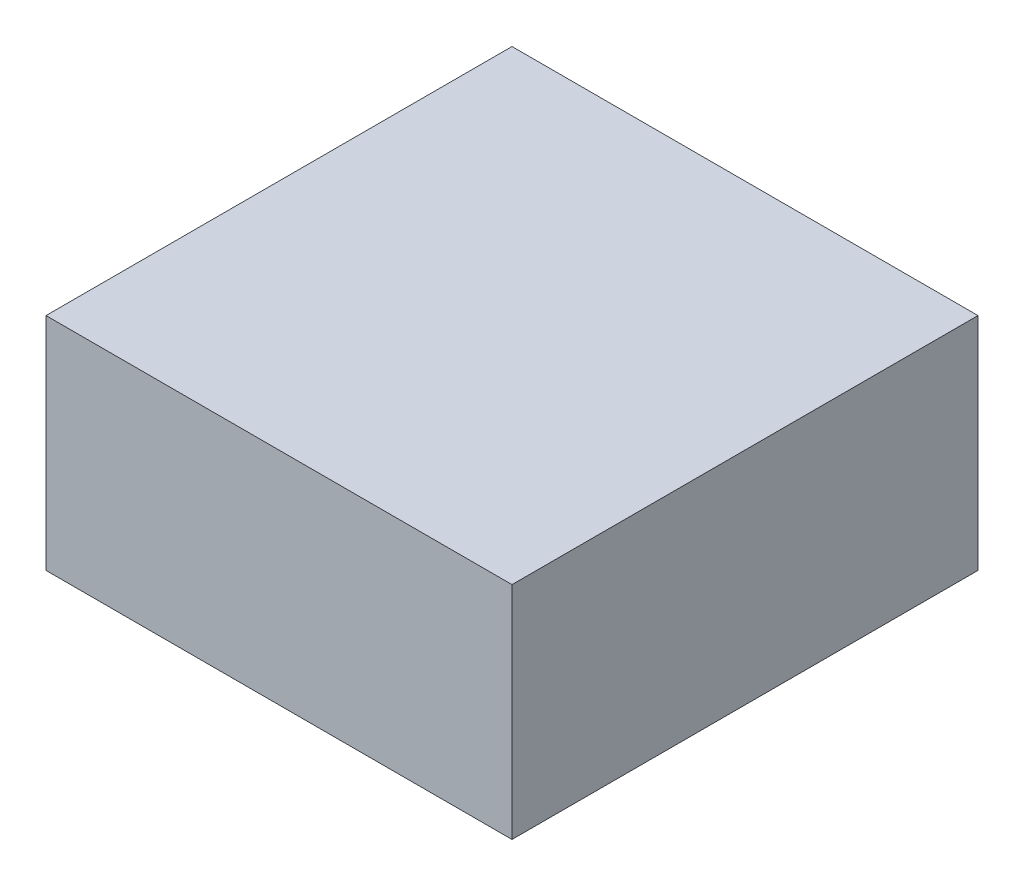
ISO-10303-21;
HEADER;
FILE_DESCRIPTION(('STEP AP214'),'2;1');
FILE_NAME('part.step','',(''),(''),'','','');
FILE_SCHEMA(('AUTOMOTIVE_DESIGN { 1 0 10303 214 1 1 1 1 }'));
ENDSEC;
DATA;
#1=APPLICATION_CONTEXT('core data for automotive mechanical design processes');
#2=APPLICATION_PROTOCOL_DEFINITION('international standard','automotive_design',2000,#1);
#3=PRODUCT_CONTEXT('',#1,'mechanical');
#4=PRODUCT('Part','Part','',(#3));
#5=PRODUCT_RELATED_PRODUCT_CATEGORY('part','',(#4));
#6=PRODUCT_DEFINITION_FORMATION('','',#4);
#7=PRODUCT_DEFINITION_CONTEXT('part definition',#1,'design');
#8=PRODUCT_DEFINITION('design','',#6,#7);
#9=PRODUCT_DEFINITION_SHAPE('','',#8);
#10=(LENGTH_UNIT() NAMED_UNIT(*) SI_UNIT(.MILLI.,.METRE.));
#11=(NAMED_UNIT(*) PLANE_ANGLE_UNIT() SI_UNIT($,.RADIAN.));
#12=(NAMED_UNIT(*) SI_UNIT($,.STERADIAN.) SOLID_ANGLE_UNIT());
#13=UNCERTAINTY_MEASURE_WITH_UNIT(LENGTH_MEASURE(1.E-05),#10,'distance_accuracy_value','');
#14=(GEOMETRIC_REPRESENTATION_CONTEXT(3) GLOBAL_UNCERTAINTY_ASSIGNED_CONTEXT((#13)) GLOBAL_UNIT_ASSIGNED_CONTEXT((#10,
#11,#12)) REPRESENTATION_CONTEXT('',''));
#15=CARTESIAN_POINT('',(0.,0.,0.));
#16=DIRECTION('',(0.,0.,1.));
#17=DIRECTION('',(1.,0.,0.));
#18=AXIS2_PLACEMENT_3D('',#15,#16,#17);
#19=CARTESIAN_POINT('',(0.,18.,0.));
#20=DIRECTION('',(1.,0.,0.));
#21=DIRECTION('',(0.,0.,-1.));
#22=AXIS2_PLACEMENT_3D('',#19,#20,#21);
#23=PLANE('',#22);
#24=DIRECTION('',(0.,0.,1.));
#25=VECTOR('',#24,1.);
#26=CARTESIAN_POINT('',(0.,0.,0.));
#27=LINE('',#26,#25);
#28=CARTESIAN_POINT('',(0.,0.,-38.));
#29=VERTEX_POINT('',#28);
#30=CARTESIAN_POINT('',(0.,0.,0.));
#31=VERTEX_POINT('',#30);
#32=EDGE_CURVE('E96',#29,#31,#27,.T.);
#33=ORIENTED_EDGE('',*,*,#32,.T.);
#34=DIRECTION('',(0.,-1.,0.));
#35=VECTOR('',#34,1.);
#36=CARTESIAN_POINT('',(0.,18.,0.));
#37=LINE('',#36,#35);
#38=CARTESIAN_POINT('',(0.,18.,0.));
#39=VERTEX_POINT('',#38);
#40=EDGE_CURVE('E11',#39,#31,#37,.T.);
#41=ORIENTED_EDGE('',*,*,#40,.F.);
#42=DIRECTION('',(0.,0.,1.));
#43=VECTOR('',#42,1.);
#44=CARTESIAN_POINT('',(0.,18.,0.));
#45=LINE('',#44,#43);
#46=CARTESIAN_POINT('',(0.,18.,-38.));
#47=VERTEX_POINT('',#46);
#48=EDGE_CURVE('E84',#47,#39,#45,.T.);
#49=ORIENTED_EDGE('',*,*,#48,.F.);
#50=DIRECTION('',(0.,-1.,0.));
#51=VECTOR('',#50,1.);
#52=CARTESIAN_POINT('',(0.,18.,-38.));
#53=LINE('',#52,#51);
#54=EDGE_CURVE('E92',#47,#29,#53,.T.);
#55=ORIENTED_EDGE('',*,*,#54,.T.);
#56=EDGE_LOOP('',(#33,#41,#49,#55));
#57=FACE_BOUND('',#56,.T.);
#58=ADVANCED_FACE('F33',(#57),#23,.F.);
#59=CARTESIAN_POINT('',(0.,18.,0.));
#60=DIRECTION('',(0.,0.,-1.));
#61=DIRECTION('',(-1.,0.,0.));
#62=AXIS2_PLACEMENT_3D('',#59,#60,#61);
#63=PLANE('',#62);
#64=DIRECTION('',(1.,0.,0.));
#65=VECTOR('',#64,1.);
#66=CARTESIAN_POINT('',(0.,0.,0.));
#67=LINE('',#66,#65);
#68=CARTESIAN_POINT('',(38.,0.,0.));
#69=VERTEX_POINT('',#68);
#70=EDGE_CURVE('E88',#31,#69,#67,.T.);
#71=ORIENTED_EDGE('',*,*,#70,.T.);
#72=DIRECTION('',(0.,-1.,0.));
#73=VECTOR('',#72,1.);
#74=CARTESIAN_POINT('',(38.,18.,0.));
#75=LINE('',#74,#73);
#76=CARTESIAN_POINT('',(38.,18.,0.));
#77=VERTEX_POINT('',#76);
#78=EDGE_CURVE('E41',#77,#69,#75,.T.);
#79=ORIENTED_EDGE('',*,*,#78,.F.);
#80=DIRECTION('',(1.,0.,0.));
#81=VECTOR('',#80,1.);
#82=CARTESIAN_POINT('',(0.,18.,0.));
#83=LINE('',#82,#81);
#84=EDGE_CURVE('E79',#39,#77,#83,.T.);
#85=ORIENTED_EDGE('',*,*,#84,.F.);
#86=ORIENTED_EDGE('',*,*,#40,.T.);
#87=EDGE_LOOP('',(#71,#79,#85,#86));
#88=FACE_BOUND('',#87,.T.);
#89=ADVANCED_FACE('F87',(#88),#63,.F.);
#90=CARTESIAN_POINT('',(38.,18.,0.));
#91=DIRECTION('',(-1.,0.,0.));
#92=DIRECTION('',(0.,0.,1.));
#93=AXIS2_PLACEMENT_3D('',#90,#91,#92);
#94=PLANE('',#93);
#95=DIRECTION('',(0.,0.,-1.));
#96=VECTOR('',#95,1.);
#97=CARTESIAN_POINT('',(38.,0.,0.));
#98=LINE('',#97,#96);
#99=CARTESIAN_POINT('',(38.,0.,-38.));
#100=VERTEX_POINT('',#99);
#101=EDGE_CURVE('E66',#69,#100,#98,.T.);
#102=ORIENTED_EDGE('',*,*,#101,.T.);
#103=DIRECTION('',(0.,-1.,0.));
#104=VECTOR('',#103,1.);
#105=CARTESIAN_POINT('',(38.,18.,-38.));
#106=LINE('',#105,#104);
#107=CARTESIAN_POINT('',(38.,18.,-38.));
#108=VERTEX_POINT('',#107);
#109=EDGE_CURVE('E89',#108,#100,#106,.T.);
#110=ORIENTED_EDGE('',*,*,#109,.F.);
#111=DIRECTION('',(0.,0.,-1.));
#112=VECTOR('',#111,1.);
#113=CARTESIAN_POINT('',(38.,18.,0.));
#114=LINE('',#113,#112);
#115=EDGE_CURVE('E82',#77,#108,#114,.T.);
#116=ORIENTED_EDGE('',*,*,#115,.F.);
#117=ORIENTED_EDGE('',*,*,#78,.T.);
#118=EDGE_LOOP('',(#102,#110,#116,#117));
#119=FACE_BOUND('',#118,.T.);
#120=ADVANCED_FACE('F90',(#119),#94,.F.);
#121=CARTESIAN_POINT('',(0.,18.,-38.));
#122=DIRECTION('',(0.,0.,1.));
#123=DIRECTION('',(1.,0.,0.));
#124=AXIS2_PLACEMENT_3D('',#121,#122,#123);
#125=PLANE('',#124);
#126=DIRECTION('',(-1.,0.,0.));
#127=VECTOR('',#126,1.);
#128=CARTESIAN_POINT('',(0.,0.,-38.));
#129=LINE('',#128,#127);
#130=EDGE_CURVE('E72',#100,#29,#129,.T.);
#131=ORIENTED_EDGE('',*,*,#130,.T.);
#132=ORIENTED_EDGE('',*,*,#54,.F.);
#133=DIRECTION('',(-1.,0.,0.));
#134=VECTOR('',#133,1.);
#135=CARTESIAN_POINT('',(0.,18.,-38.));
#136=LINE('',#135,#134);
#137=EDGE_CURVE('E49',#108,#47,#136,.T.);
#138=ORIENTED_EDGE('',*,*,#137,.F.);
#139=ORIENTED_EDGE('',*,*,#109,.T.);
#140=EDGE_LOOP('',(#131,#132,#138,#139));
#141=FACE_BOUND('',#140,.T.);
#142=ADVANCED_FACE('F103',(#141),#125,.F.);
#143=CARTESIAN_POINT('',(0.,18.,0.));
#144=DIRECTION('',(0.,-1.,0.));
#145=DIRECTION('',(0.,0.,-1.));
#146=AXIS2_PLACEMENT_3D('',#143,#144,#145);
#147=PLANE('',#146);
#148=ORIENTED_EDGE('',*,*,#48,.T.);
#149=ORIENTED_EDGE('',*,*,#84,.T.);
#150=ORIENTED_EDGE('',*,*,#115,.T.);
#151=ORIENTED_EDGE('',*,*,#137,.T.);
#152=EDGE_LOOP('',(#148,#149,#150,#151));
#153=FACE_BOUND('',#152,.T.);
#154=ADVANCED_FACE('F80',(#153),#147,.F.);
#155=CARTESIAN_POINT('',(0.,0.,0.));
#156=DIRECTION('',(0.,-1.,0.));
#157=DIRECTION('',(0.,0.,-1.));
#158=AXIS2_PLACEMENT_3D('',#155,#156,#157);
#159=PLANE('',#158);
#160=ORIENTED_EDGE('',*,*,#32,.F.);
#161=ORIENTED_EDGE('',*,*,#130,.F.);
#162=ORIENTED_EDGE('',*,*,#101,.F.);
#163=ORIENTED_EDGE('',*,*,#70,.F.);
#164=EDGE_LOOP('',(#160,#161,#162,#163));
#165=FACE_BOUND('',#164,.T.);
#166=ADVANCED_FACE('F106',(#165),#159,.T.);
#167=CLOSED_SHELL('',(#58,#89,#120,#142,#154,#166));
#168=MANIFOLD_SOLID_BREP('B2',#167);
#169=ADVANCED_BREP_SHAPE_REPRESENTATION('',(#18,#168),#14);
#170=SHAPE_DEFINITION_REPRESENTATION(#9,#169);
ENDSEC;
END-ISO-10303-21;
